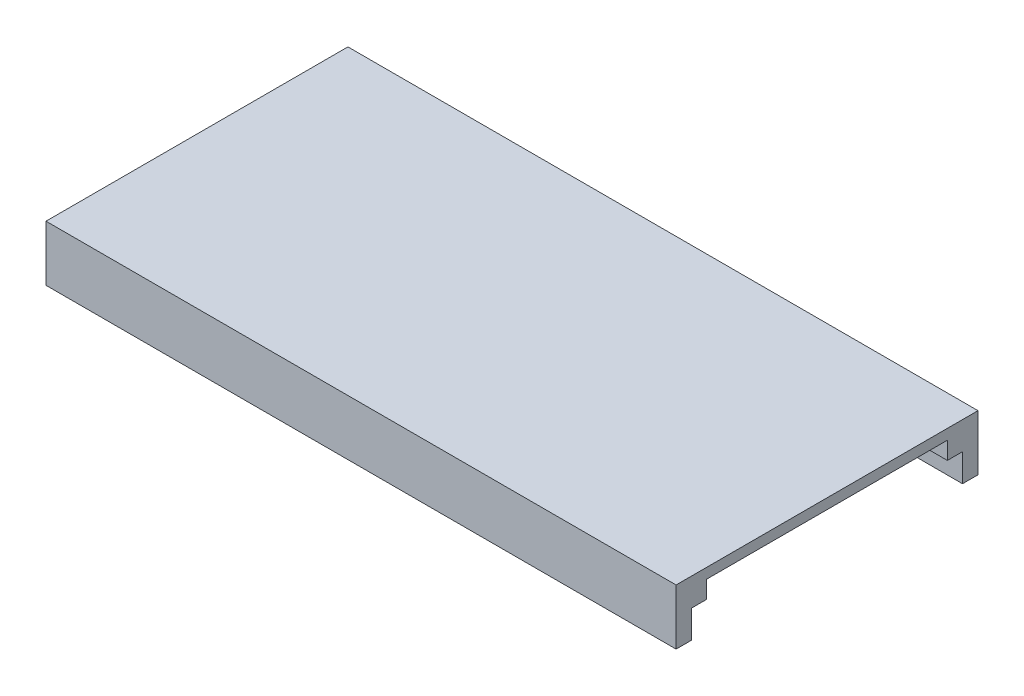
ISO-10303-21;
HEADER;
FILE_DESCRIPTION(('STEP AP214'),'2;1');
FILE_NAME('part.step','',(''),(''),'','','');
FILE_SCHEMA(('AUTOMOTIVE_DESIGN { 1 0 10303 214 1 1 1 1 }'));
ENDSEC;
DATA;
#1=APPLICATION_CONTEXT('core data for automotive mechanical design processes');
#2=APPLICATION_PROTOCOL_DEFINITION('international standard','automotive_design',2000,#1);
#3=PRODUCT_CONTEXT('',#1,'mechanical');
#4=PRODUCT('Part','Part','',(#3));
#5=PRODUCT_RELATED_PRODUCT_CATEGORY('part','',(#4));
#6=PRODUCT_DEFINITION_FORMATION('','',#4);
#7=PRODUCT_DEFINITION_CONTEXT('part definition',#1,'design');
#8=PRODUCT_DEFINITION('design','',#6,#7);
#9=PRODUCT_DEFINITION_SHAPE('','',#8);
#10=(LENGTH_UNIT() NAMED_UNIT(*) SI_UNIT(.MILLI.,.METRE.));
#11=(NAMED_UNIT(*) PLANE_ANGLE_UNIT() SI_UNIT($,.RADIAN.));
#12=(NAMED_UNIT(*) SI_UNIT($,.STERADIAN.) SOLID_ANGLE_UNIT());
#13=UNCERTAINTY_MEASURE_WITH_UNIT(LENGTH_MEASURE(1.E-05),#10,'distance_accuracy_value','');
#14=(GEOMETRIC_REPRESENTATION_CONTEXT(3) GLOBAL_UNCERTAINTY_ASSIGNED_CONTEXT((#13)) GLOBAL_UNIT_ASSIGNED_CONTEXT((#10,
#11,#12)) REPRESENTATION_CONTEXT('',''));
#15=CARTESIAN_POINT('',(0.,0.,0.));
#16=DIRECTION('',(0.,0.,1.));
#17=DIRECTION('',(1.,0.,0.));
#18=AXIS2_PLACEMENT_3D('',#15,#16,#17);
#19=CARTESIAN_POINT('',(0.,-6.36,34.5));
#20=DIRECTION('',(1.,0.,0.));
#21=DIRECTION('',(0.,0.,-1.));
#22=AXIS2_PLACEMENT_3D('',#19,#20,#21);
#23=PLANE('',#22);
#24=DIRECTION('',(0.,-1.,0.));
#25=VECTOR('',#24,1.);
#26=CARTESIAN_POINT('',(0.,6.35,34.5));
#27=LINE('',#26,#25);
#28=CARTESIAN_POINT('',(0.,6.35,34.5));
#29=VERTEX_POINT('',#28);
#30=CARTESIAN_POINT('',(0.,-6.35,34.5));
#31=VERTEX_POINT('',#30);
#32=EDGE_CURVE('E164',#29,#31,#27,.T.);
#33=ORIENTED_EDGE('',*,*,#32,.T.);
#34=DIRECTION('',(0.,0.,-1.));
#35=VECTOR('',#34,1.);
#36=CARTESIAN_POINT('',(0.,-6.35,0.));
#37=LINE('',#36,#35);
#38=CARTESIAN_POINT('',(0.,-6.35,30.95625));
#39=VERTEX_POINT('',#38);
#40=EDGE_CURVE('E167',#31,#39,#37,.T.);
#41=ORIENTED_EDGE('',*,*,#40,.T.);
#42=DIRECTION('',(0.,1.,0.));
#43=VECTOR('',#42,1.);
#44=CARTESIAN_POINT('',(0.,0.,30.95625));
#45=LINE('',#44,#43);
#46=CARTESIAN_POINT('',(0.,0.,30.95625));
#47=VERTEX_POINT('',#46);
#48=EDGE_CURVE('E174',#39,#47,#45,.T.);
#49=ORIENTED_EDGE('',*,*,#48,.T.);
#50=DIRECTION('',(0.,0.,-1.));
#51=VECTOR('',#50,1.);
#52=CARTESIAN_POINT('',(0.,0.,0.));
#53=LINE('',#52,#51);
#54=CARTESIAN_POINT('',(0.,0.,27.5));
#55=VERTEX_POINT('',#54);
#56=EDGE_CURVE('E158',#47,#55,#53,.T.);
#57=ORIENTED_EDGE('',*,*,#56,.T.);
#58=DIRECTION('',(0.,1.,0.));
#59=VECTOR('',#58,1.);
#60=CARTESIAN_POINT('',(0.,4.,27.5));
#61=LINE('',#60,#59);
#62=CARTESIAN_POINT('',(0.,4.,27.5));
#63=VERTEX_POINT('',#62);
#64=EDGE_CURVE('E180',#55,#63,#61,.T.);
#65=ORIENTED_EDGE('',*,*,#64,.T.);
#66=DIRECTION('',(0.,0.,1.));
#67=VECTOR('',#66,1.);
#68=CARTESIAN_POINT('',(0.,4.,0.));
#69=LINE('',#68,#67);
#70=CARTESIAN_POINT('',(0.,4.,-27.5));
#71=VERTEX_POINT('',#70);
#72=EDGE_CURVE('E124',#71,#63,#69,.T.);
#73=ORIENTED_EDGE('',*,*,#72,.F.);
#74=DIRECTION('',(0.,-1.,0.));
#75=VECTOR('',#74,1.);
#76=CARTESIAN_POINT('',(0.,4.,-27.5));
#77=LINE('',#76,#75);
#78=CARTESIAN_POINT('',(0.,0.,-27.5));
#79=VERTEX_POINT('',#78);
#80=EDGE_CURVE('E177',#71,#79,#77,.T.);
#81=ORIENTED_EDGE('',*,*,#80,.T.);
#82=CARTESIAN_POINT('',(0.,0.,-30.95625));
#83=VERTEX_POINT('',#82);
#84=EDGE_CURVE('E159',#79,#83,#53,.T.);
#85=ORIENTED_EDGE('',*,*,#84,.T.);
#86=DIRECTION('',(0.,-1.,0.));
#87=VECTOR('',#86,1.);
#88=CARTESIAN_POINT('',(0.,0.,-30.95625));
#89=LINE('',#88,#87);
#90=CARTESIAN_POINT('',(0.,-6.35,-30.95625));
#91=VERTEX_POINT('',#90);
#92=EDGE_CURVE('E171',#83,#91,#89,.T.);
#93=ORIENTED_EDGE('',*,*,#92,.T.);
#94=CARTESIAN_POINT('',(0.,-6.35,-34.5));
#95=VERTEX_POINT('',#94);
#96=EDGE_CURVE('E168',#91,#95,#37,.T.);
#97=ORIENTED_EDGE('',*,*,#96,.T.);
#98=DIRECTION('',(0.,1.,0.));
#99=VECTOR('',#98,1.);
#100=CARTESIAN_POINT('',(0.,6.35,-34.5));
#101=LINE('',#100,#99);
#102=CARTESIAN_POINT('',(0.,6.35,-34.5));
#103=VERTEX_POINT('',#102);
#104=EDGE_CURVE('E162',#95,#103,#101,.T.);
#105=ORIENTED_EDGE('',*,*,#104,.T.);
#106=DIRECTION('',(0.,0.,-1.));
#107=VECTOR('',#106,1.);
#108=CARTESIAN_POINT('',(0.,6.35,0.));
#109=LINE('',#108,#107);
#110=EDGE_CURVE('E115',#29,#103,#109,.T.);
#111=ORIENTED_EDGE('',*,*,#110,.F.);
#112=EDGE_LOOP('',(#33,#41,#49,#57,#65,#73,#81,#85,#93,#97,#105,#111));
#113=FACE_BOUND('',#112,.T.);
#114=ADVANCED_FACE('F36',(#113),#23,.T.);
#115=CARTESIAN_POINT('',(-144.,6.35,-34.5));
#116=DIRECTION('',(0.,0.,1.));
#117=DIRECTION('',(1.,0.,0.));
#118=AXIS2_PLACEMENT_3D('',#115,#116,#117);
#119=PLANE('',#118);
#120=ORIENTED_EDGE('',*,*,#104,.F.);
#121=DIRECTION('',(-1.,0.,0.));
#122=VECTOR('',#121,1.);
#123=CARTESIAN_POINT('',(-144.,-6.35,-34.5));
#124=LINE('',#123,#122);
#125=CARTESIAN_POINT('',(-144.,-6.35,-34.5));
#126=VERTEX_POINT('',#125);
#127=EDGE_CURVE('E93',#95,#126,#124,.T.);
#128=ORIENTED_EDGE('',*,*,#127,.T.);
#129=DIRECTION('',(0.,-1.,0.));
#130=VECTOR('',#129,1.);
#131=CARTESIAN_POINT('',(-144.,6.35,-34.5));
#132=LINE('',#131,#130);
#133=CARTESIAN_POINT('',(-144.,6.35,-34.5));
#134=VERTEX_POINT('',#133);
#135=EDGE_CURVE('E119',#134,#126,#132,.T.);
#136=ORIENTED_EDGE('',*,*,#135,.F.);
#137=DIRECTION('',(-1.,0.,0.));
#138=VECTOR('',#137,1.);
#139=CARTESIAN_POINT('',(-144.,6.35,-34.5));
#140=LINE('',#139,#138);
#141=EDGE_CURVE('E107',#103,#134,#140,.T.);
#142=ORIENTED_EDGE('',*,*,#141,.F.);
#143=EDGE_LOOP('',(#120,#128,#136,#142));
#144=FACE_BOUND('',#143,.T.);
#145=ADVANCED_FACE('F120',(#144),#119,.F.);
#146=CARTESIAN_POINT('',(-144.,6.35,-34.5));
#147=DIRECTION('',(1.,0.,0.));
#148=DIRECTION('',(0.,0.,-1.));
#149=AXIS2_PLACEMENT_3D('',#146,#147,#148);
#150=PLANE('',#149);
#151=DIRECTION('',(0.,0.,1.));
#152=VECTOR('',#151,1.);
#153=CARTESIAN_POINT('',(-144.,-6.35,-34.5));
#154=LINE('',#153,#152);
#155=CARTESIAN_POINT('',(-144.,-6.35,34.5));
#156=VERTEX_POINT('',#155);
#157=EDGE_CURVE('E134',#126,#156,#154,.T.);
#158=ORIENTED_EDGE('',*,*,#157,.T.);
#159=DIRECTION('',(0.,-1.,0.));
#160=VECTOR('',#159,1.);
#161=CARTESIAN_POINT('',(-144.,6.35,34.5));
#162=LINE('',#161,#160);
#163=CARTESIAN_POINT('',(-144.,6.35,34.5));
#164=VERTEX_POINT('',#163);
#165=EDGE_CURVE('E123',#164,#156,#162,.T.);
#166=ORIENTED_EDGE('',*,*,#165,.F.);
#167=DIRECTION('',(0.,0.,1.));
#168=VECTOR('',#167,1.);
#169=CARTESIAN_POINT('',(-144.,6.35,-34.5));
#170=LINE('',#169,#168);
#171=EDGE_CURVE('E111',#134,#164,#170,.T.);
#172=ORIENTED_EDGE('',*,*,#171,.F.);
#173=ORIENTED_EDGE('',*,*,#135,.T.);
#174=EDGE_LOOP('',(#158,#166,#172,#173));
#175=FACE_BOUND('',#174,.T.);
#176=ADVANCED_FACE('F126',(#175),#150,.F.);
#177=CARTESIAN_POINT('',(-144.,6.35,34.5));
#178=DIRECTION('',(0.,0.,-1.));
#179=DIRECTION('',(-1.,0.,0.));
#180=AXIS2_PLACEMENT_3D('',#177,#178,#179);
#181=PLANE('',#180);
#182=ORIENTED_EDGE('',*,*,#32,.F.);
#183=DIRECTION('',(1.,0.,0.));
#184=VECTOR('',#183,1.);
#185=CARTESIAN_POINT('',(-144.,6.35,34.5));
#186=LINE('',#185,#184);
#187=EDGE_CURVE('E129',#164,#29,#186,.T.);
#188=ORIENTED_EDGE('',*,*,#187,.F.);
#189=ORIENTED_EDGE('',*,*,#165,.T.);
#190=DIRECTION('',(1.,0.,0.));
#191=VECTOR('',#190,1.);
#192=CARTESIAN_POINT('',(-144.,-6.35,34.5));
#193=LINE('',#192,#191);
#194=EDGE_CURVE('E117',#156,#31,#193,.T.);
#195=ORIENTED_EDGE('',*,*,#194,.T.);
#196=EDGE_LOOP('',(#182,#188,#189,#195));
#197=FACE_BOUND('',#196,.T.);
#198=ADVANCED_FACE('F245',(#197),#181,.F.);
#199=CARTESIAN_POINT('',(0.,0.,0.));
#200=DIRECTION('',(0.,1.,0.));
#201=DIRECTION('',(0.,0.,1.));
#202=AXIS2_PLACEMENT_3D('',#199,#200,#201);
#203=PLANE('',#202);
#204=ORIENTED_EDGE('',*,*,#56,.F.);
#205=DIRECTION('',(-1.,0.,0.));
#206=VECTOR('',#205,1.);
#207=CARTESIAN_POINT('',(-140.096875,0.,30.95625));
#208=LINE('',#207,#206);
#209=CARTESIAN_POINT('',(-140.096875,0.,30.95625));
#210=VERTEX_POINT('',#209);
#211=EDGE_CURVE('E145',#47,#210,#208,.T.);
#212=ORIENTED_EDGE('',*,*,#211,.T.);
#213=DIRECTION('',(0.,0.,-1.));
#214=VECTOR('',#213,1.);
#215=CARTESIAN_POINT('',(-140.096875,0.,-30.95625));
#216=LINE('',#215,#214);
#217=CARTESIAN_POINT('',(-140.096875,0.,-30.95625));
#218=VERTEX_POINT('',#217);
#219=EDGE_CURVE('E143',#210,#218,#216,.T.);
#220=ORIENTED_EDGE('',*,*,#219,.T.);
#221=DIRECTION('',(1.,0.,0.));
#222=VECTOR('',#221,1.);
#223=CARTESIAN_POINT('',(-140.096875,0.,-30.95625));
#224=LINE('',#223,#222);
#225=EDGE_CURVE('E138',#218,#83,#224,.T.);
#226=ORIENTED_EDGE('',*,*,#225,.T.);
#227=ORIENTED_EDGE('',*,*,#84,.F.);
#228=DIRECTION('',(1.,0.,0.));
#229=VECTOR('',#228,1.);
#230=CARTESIAN_POINT('',(-135.675,0.,-27.5));
#231=LINE('',#230,#229);
#232=CARTESIAN_POINT('',(-135.675,0.,-27.5));
#233=VERTEX_POINT('',#232);
#234=EDGE_CURVE('E151',#233,#79,#231,.T.);
#235=ORIENTED_EDGE('',*,*,#234,.F.);
#236=DIRECTION('',(0.,0.,-1.));
#237=VECTOR('',#236,1.);
#238=CARTESIAN_POINT('',(-135.675,0.,27.5));
#239=LINE('',#238,#237);
#240=CARTESIAN_POINT('',(-135.675,0.,27.5));
#241=VERTEX_POINT('',#240);
#242=EDGE_CURVE('E45',#241,#233,#239,.T.);
#243=ORIENTED_EDGE('',*,*,#242,.F.);
#244=DIRECTION('',(-1.,0.,0.));
#245=VECTOR('',#244,1.);
#246=CARTESIAN_POINT('',(-135.675,0.,27.5));
#247=LINE('',#246,#245);
#248=EDGE_CURVE('E11',#55,#241,#247,.T.);
#249=ORIENTED_EDGE('',*,*,#248,.F.);
#250=EDGE_LOOP('',(#204,#212,#220,#226,#227,#235,#243,#249));
#251=FACE_BOUND('',#250,.T.);
#252=ADVANCED_FACE('F209',(#251),#203,.F.);
#253=CARTESIAN_POINT('',(-135.675,4.,27.5));
#254=DIRECTION('',(-1.,0.,0.));
#255=DIRECTION('',(0.,0.,1.));
#256=AXIS2_PLACEMENT_3D('',#253,#254,#255);
#257=PLANE('',#256);
#258=ORIENTED_EDGE('',*,*,#242,.T.);
#259=DIRECTION('',(0.,-1.,0.));
#260=VECTOR('',#259,1.);
#261=CARTESIAN_POINT('',(-135.675,4.,-27.5));
#262=LINE('',#261,#260);
#263=CARTESIAN_POINT('',(-135.675,4.,-27.5));
#264=VERTEX_POINT('',#263);
#265=EDGE_CURVE('E63',#264,#233,#262,.T.);
#266=ORIENTED_EDGE('',*,*,#265,.F.);
#267=DIRECTION('',(0.,0.,-1.));
#268=VECTOR('',#267,1.);
#269=CARTESIAN_POINT('',(-135.675,4.,27.5));
#270=LINE('',#269,#268);
#271=CARTESIAN_POINT('',(-135.675,4.,27.5));
#272=VERTEX_POINT('',#271);
#273=EDGE_CURVE('E152',#272,#264,#270,.T.);
#274=ORIENTED_EDGE('',*,*,#273,.F.);
#275=DIRECTION('',(0.,-1.,0.));
#276=VECTOR('',#275,1.);
#277=CARTESIAN_POINT('',(-135.675,4.,27.5));
#278=LINE('',#277,#276);
#279=EDGE_CURVE('E146',#272,#241,#278,.T.);
#280=ORIENTED_EDGE('',*,*,#279,.T.);
#281=EDGE_LOOP('',(#258,#266,#274,#280));
#282=FACE_BOUND('',#281,.T.);
#283=ADVANCED_FACE('F238',(#282),#257,.F.);
#284=CARTESIAN_POINT('',(-135.675,4.,27.5));
#285=DIRECTION('',(0.,0.,1.));
#286=DIRECTION('',(1.,0.,0.));
#287=AXIS2_PLACEMENT_3D('',#284,#285,#286);
#288=PLANE('',#287);
#289=ORIENTED_EDGE('',*,*,#64,.F.);
#290=ORIENTED_EDGE('',*,*,#248,.T.);
#291=ORIENTED_EDGE('',*,*,#279,.F.);
#292=DIRECTION('',(-1.,0.,0.));
#293=VECTOR('',#292,1.);
#294=CARTESIAN_POINT('',(-135.675,4.,27.5));
#295=LINE('',#294,#293);
#296=EDGE_CURVE('E154',#63,#272,#295,.T.);
#297=ORIENTED_EDGE('',*,*,#296,.F.);
#298=EDGE_LOOP('',(#289,#290,#291,#297));
#299=FACE_BOUND('',#298,.T.);
#300=ADVANCED_FACE('F237',(#299),#288,.F.);
#301=CARTESIAN_POINT('',(-135.675,4.,-27.5));
#302=DIRECTION('',(0.,0.,-1.));
#303=DIRECTION('',(-1.,0.,0.));
#304=AXIS2_PLACEMENT_3D('',#301,#302,#303);
#305=PLANE('',#304);
#306=ORIENTED_EDGE('',*,*,#80,.F.);
#307=DIRECTION('',(1.,0.,0.));
#308=VECTOR('',#307,1.);
#309=CARTESIAN_POINT('',(-135.675,4.,-27.5));
#310=LINE('',#309,#308);
#311=EDGE_CURVE('E148',#264,#71,#310,.T.);
#312=ORIENTED_EDGE('',*,*,#311,.F.);
#313=ORIENTED_EDGE('',*,*,#265,.T.);
#314=ORIENTED_EDGE('',*,*,#234,.T.);
#315=EDGE_LOOP('',(#306,#312,#313,#314));
#316=FACE_BOUND('',#315,.T.);
#317=ADVANCED_FACE('F200',(#316),#305,.F.);
#318=CARTESIAN_POINT('',(0.,4.,0.));
#319=DIRECTION('',(0.,-1.,0.));
#320=DIRECTION('',(0.,0.,-1.));
#321=AXIS2_PLACEMENT_3D('',#318,#319,#320);
#322=PLANE('',#321);
#323=ORIENTED_EDGE('',*,*,#311,.T.);
#324=ORIENTED_EDGE('',*,*,#72,.T.);
#325=ORIENTED_EDGE('',*,*,#296,.T.);
#326=ORIENTED_EDGE('',*,*,#273,.T.);
#327=EDGE_LOOP('',(#323,#324,#325,#326));
#328=FACE_BOUND('',#327,.T.);
#329=ADVANCED_FACE('F38',(#328),#322,.T.);
#330=CARTESIAN_POINT('',(-140.096875,0.,-30.95625));
#331=DIRECTION('',(-1.,0.,0.));
#332=DIRECTION('',(0.,0.,1.));
#333=AXIS2_PLACEMENT_3D('',#330,#331,#332);
#334=PLANE('',#333);
#335=DIRECTION('',(0.,0.,-1.));
#336=VECTOR('',#335,1.);
#337=CARTESIAN_POINT('',(-140.096875,-6.35,-30.95625));
#338=LINE('',#337,#336);
#339=CARTESIAN_POINT('',(-140.096875,-6.35,30.95625));
#340=VERTEX_POINT('',#339);
#341=CARTESIAN_POINT('',(-140.096875,-6.35,-30.95625));
#342=VERTEX_POINT('',#341);
#343=EDGE_CURVE('E140',#340,#342,#338,.T.);
#344=ORIENTED_EDGE('',*,*,#343,.T.);
#345=DIRECTION('',(0.,-1.,0.));
#346=VECTOR('',#345,1.);
#347=CARTESIAN_POINT('',(-140.096875,0.,-30.95625));
#348=LINE('',#347,#346);
#349=EDGE_CURVE('E83',#218,#342,#348,.T.);
#350=ORIENTED_EDGE('',*,*,#349,.F.);
#351=ORIENTED_EDGE('',*,*,#219,.F.);
#352=DIRECTION('',(0.,-1.,0.));
#353=VECTOR('',#352,1.);
#354=CARTESIAN_POINT('',(-140.096875,0.,30.95625));
#355=LINE('',#354,#353);
#356=EDGE_CURVE('E136',#210,#340,#355,.T.);
#357=ORIENTED_EDGE('',*,*,#356,.T.);
#358=EDGE_LOOP('',(#344,#350,#351,#357));
#359=FACE_BOUND('',#358,.T.);
#360=ADVANCED_FACE('F268',(#359),#334,.F.);
#361=CARTESIAN_POINT('',(0.,-6.35,0.));
#362=DIRECTION('',(0.,1.,0.));
#363=DIRECTION('',(0.,0.,1.));
#364=AXIS2_PLACEMENT_3D('',#361,#362,#363);
#365=PLANE('',#364);
#366=ORIENTED_EDGE('',*,*,#40,.F.);
#367=ORIENTED_EDGE('',*,*,#194,.F.);
#368=ORIENTED_EDGE('',*,*,#157,.F.);
#369=ORIENTED_EDGE('',*,*,#127,.F.);
#370=ORIENTED_EDGE('',*,*,#96,.F.);
#371=DIRECTION('',(1.,0.,0.));
#372=VECTOR('',#371,1.);
#373=CARTESIAN_POINT('',(-140.096875,-6.35,-30.95625));
#374=LINE('',#373,#372);
#375=EDGE_CURVE('E142',#342,#91,#374,.T.);
#376=ORIENTED_EDGE('',*,*,#375,.F.);
#377=ORIENTED_EDGE('',*,*,#343,.F.);
#378=DIRECTION('',(-1.,0.,0.));
#379=VECTOR('',#378,1.);
#380=CARTESIAN_POINT('',(-140.096875,-6.35,30.95625));
#381=LINE('',#380,#379);
#382=EDGE_CURVE('E72',#39,#340,#381,.T.);
#383=ORIENTED_EDGE('',*,*,#382,.F.);
#384=EDGE_LOOP('',(#366,#367,#368,#369,#370,#376,#377,#383));
#385=FACE_BOUND('',#384,.T.);
#386=ADVANCED_FACE('F264',(#385),#365,.F.);
#387=CARTESIAN_POINT('',(-140.096875,0.,30.95625));
#388=DIRECTION('',(0.,0.,1.));
#389=DIRECTION('',(1.,0.,0.));
#390=AXIS2_PLACEMENT_3D('',#387,#388,#389);
#391=PLANE('',#390);
#392=ORIENTED_EDGE('',*,*,#48,.F.);
#393=ORIENTED_EDGE('',*,*,#382,.T.);
#394=ORIENTED_EDGE('',*,*,#356,.F.);
#395=ORIENTED_EDGE('',*,*,#211,.F.);
#396=EDGE_LOOP('',(#392,#393,#394,#395));
#397=FACE_BOUND('',#396,.T.);
#398=ADVANCED_FACE('F267',(#397),#391,.F.);
#399=CARTESIAN_POINT('',(-140.096875,0.,-30.95625));
#400=DIRECTION('',(0.,0.,-1.));
#401=DIRECTION('',(-1.,0.,0.));
#402=AXIS2_PLACEMENT_3D('',#399,#400,#401);
#403=PLANE('',#402);
#404=ORIENTED_EDGE('',*,*,#92,.F.);
#405=ORIENTED_EDGE('',*,*,#225,.F.);
#406=ORIENTED_EDGE('',*,*,#349,.T.);
#407=ORIENTED_EDGE('',*,*,#375,.T.);
#408=EDGE_LOOP('',(#404,#405,#406,#407));
#409=FACE_BOUND('',#408,.T.);
#410=ADVANCED_FACE('F263',(#409),#403,.F.);
#411=CARTESIAN_POINT('',(0.,6.35,0.));
#412=DIRECTION('',(0.,1.,0.));
#413=DIRECTION('',(0.,0.,1.));
#414=AXIS2_PLACEMENT_3D('',#411,#412,#413);
#415=PLANE('',#414);
#416=ORIENTED_EDGE('',*,*,#187,.T.);
#417=ORIENTED_EDGE('',*,*,#110,.T.);
#418=ORIENTED_EDGE('',*,*,#141,.T.);
#419=ORIENTED_EDGE('',*,*,#171,.T.);
#420=EDGE_LOOP('',(#416,#417,#418,#419));
#421=FACE_BOUND('',#420,.T.);
#422=ADVANCED_FACE('F109',(#421),#415,.T.);
#423=CLOSED_SHELL('',(#114,#145,#176,#198,#252,#283,#300,#317,#329,#360,#386,#398,#410,#422));
#424=MANIFOLD_SOLID_BREP('B2',#423);
#425=ADVANCED_BREP_SHAPE_REPRESENTATION('',(#18,#424),#14);
#426=SHAPE_DEFINITION_REPRESENTATION(#9,#425);
ENDSEC;
END-ISO-10303-21;
